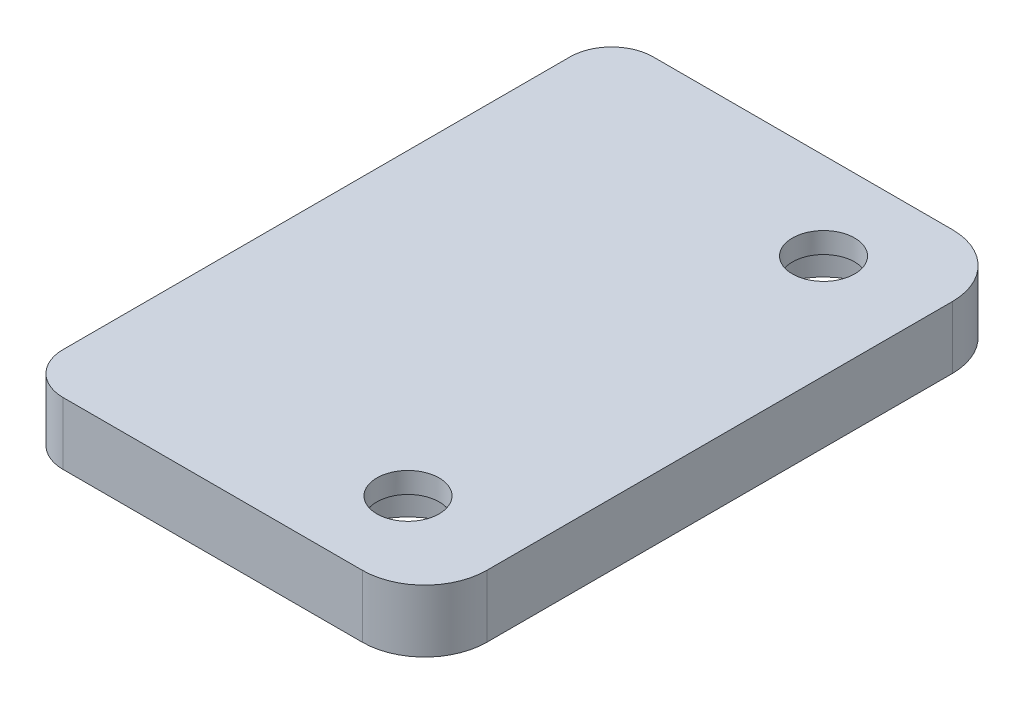
ISO-10303-21;
HEADER;
FILE_DESCRIPTION(('STEP AP214'),'2;1');
FILE_NAME('part.step','',(''),(''),'','','');
FILE_SCHEMA(('AUTOMOTIVE_DESIGN { 1 0 10303 214 1 1 1 1 }'));
ENDSEC;
DATA;
#1=APPLICATION_CONTEXT('core data for automotive mechanical design processes');
#2=APPLICATION_PROTOCOL_DEFINITION('international standard','automotive_design',2000,#1);
#3=PRODUCT_CONTEXT('',#1,'mechanical');
#4=PRODUCT('Part','Part','',(#3));
#5=PRODUCT_RELATED_PRODUCT_CATEGORY('part','',(#4));
#6=PRODUCT_DEFINITION_FORMATION('','',#4);
#7=PRODUCT_DEFINITION_CONTEXT('part definition',#1,'design');
#8=PRODUCT_DEFINITION('design','',#6,#7);
#9=PRODUCT_DEFINITION_SHAPE('','',#8);
#10=(LENGTH_UNIT() NAMED_UNIT(*) SI_UNIT(.MILLI.,.METRE.));
#11=(NAMED_UNIT(*) PLANE_ANGLE_UNIT() SI_UNIT($,.RADIAN.));
#12=(NAMED_UNIT(*) SI_UNIT($,.STERADIAN.) SOLID_ANGLE_UNIT());
#13=UNCERTAINTY_MEASURE_WITH_UNIT(LENGTH_MEASURE(1.E-05),#10,'distance_accuracy_value','');
#14=(GEOMETRIC_REPRESENTATION_CONTEXT(3) GLOBAL_UNCERTAINTY_ASSIGNED_CONTEXT((#13)) GLOBAL_UNIT_ASSIGNED_CONTEXT((#10,
#11,#12)) REPRESENTATION_CONTEXT('',''));
#15=CARTESIAN_POINT('',(0.,0.,0.));
#16=DIRECTION('',(0.,0.,1.));
#17=DIRECTION('',(1.,0.,0.));
#18=AXIS2_PLACEMENT_3D('',#15,#16,#17);
#19=CARTESIAN_POINT('',(4.7,0.,10.));
#20=DIRECTION('',(0.,1.,0.));
#21=DIRECTION('',(0.,0.,1.));
#22=AXIS2_PLACEMENT_3D('',#19,#20,#21);
#23=CYLINDRICAL_SURFACE('',#22,1.5);
#24=CARTESIAN_POINT('',(4.7,3.,10.));
#25=DIRECTION('',(0.,1.,0.));
#26=DIRECTION('',(0.,0.,1.));
#27=AXIS2_PLACEMENT_3D('',#24,#25,#26);
#28=CIRCLE('',#27,1.5);
#29=CARTESIAN_POINT('',(4.7,3.,11.5));
#30=VERTEX_POINT('',#29);
#31=EDGE_CURVE('E161',#30,#30,#28,.T.);
#32=ORIENTED_EDGE('',*,*,#31,.T.);
#33=EDGE_LOOP('',(#32));
#34=FACE_BOUND('',#33,.T.);
#35=CARTESIAN_POINT('',(4.7,2.,10.));
#36=DIRECTION('',(0.,-1.,0.));
#37=DIRECTION('',(0.,0.,-1.));
#38=AXIS2_PLACEMENT_3D('',#35,#36,#37);
#39=CIRCLE('',#38,1.5);
#40=CARTESIAN_POINT('',(4.7,2.,8.5));
#41=VERTEX_POINT('',#40);
#42=EDGE_CURVE('E38',#41,#41,#39,.F.);
#43=ORIENTED_EDGE('',*,*,#42,.F.);
#44=EDGE_LOOP('',(#43));
#45=FACE_BOUND('',#44,.T.);
#46=ADVANCED_FACE('F34',(#34,#45),#23,.F.);
#47=CARTESIAN_POINT('',(4.7,0.,-10.));
#48=DIRECTION('',(0.,1.,0.));
#49=DIRECTION('',(0.,0.,1.));
#50=AXIS2_PLACEMENT_3D('',#47,#48,#49);
#51=CYLINDRICAL_SURFACE('',#50,1.5);
#52=CARTESIAN_POINT('',(4.7,3.,-10.));
#53=DIRECTION('',(0.,1.,0.));
#54=DIRECTION('',(0.,0.,1.));
#55=AXIS2_PLACEMENT_3D('',#52,#53,#54);
#56=CIRCLE('',#55,1.5);
#57=CARTESIAN_POINT('',(4.7,3.,-8.5));
#58=VERTEX_POINT('',#57);
#59=EDGE_CURVE('E176',#58,#58,#56,.T.);
#60=ORIENTED_EDGE('',*,*,#59,.T.);
#61=EDGE_LOOP('',(#60));
#62=FACE_BOUND('',#61,.T.);
#63=CARTESIAN_POINT('',(4.7,2.,-10.));
#64=DIRECTION('',(0.,-1.,0.));
#65=DIRECTION('',(0.,0.,-1.));
#66=AXIS2_PLACEMENT_3D('',#63,#64,#65);
#67=CIRCLE('',#66,1.5);
#68=CARTESIAN_POINT('',(4.7,2.,-11.5));
#69=VERTEX_POINT('',#68);
#70=EDGE_CURVE('E155',#69,#69,#67,.F.);
#71=ORIENTED_EDGE('',*,*,#70,.F.);
#72=EDGE_LOOP('',(#71));
#73=FACE_BOUND('',#72,.T.);
#74=ADVANCED_FACE('F211',(#62,#73),#51,.F.);
#75=CARTESIAN_POINT('',(-9.7,3.,-14.2));
#76=DIRECTION('',(1.,0.,0.));
#77=DIRECTION('',(0.,0.,-1.));
#78=AXIS2_PLACEMENT_3D('',#75,#76,#77);
#79=PLANE('',#78);
#80=DIRECTION('',(0.,0.,1.));
#81=VECTOR('',#80,1.);
#82=CARTESIAN_POINT('',(-9.7,3.,-14.2));
#83=LINE('',#82,#81);
#84=CARTESIAN_POINT('',(-9.7,3.,-12.2));
#85=VERTEX_POINT('',#84);
#86=CARTESIAN_POINT('',(-9.7,3.,12.2));
#87=VERTEX_POINT('',#86);
#88=EDGE_CURVE('E124',#85,#87,#83,.T.);
#89=ORIENTED_EDGE('',*,*,#88,.F.);
#90=DIRECTION('',(0.,-1.,0.));
#91=VECTOR('',#90,1.);
#92=CARTESIAN_POINT('',(-9.7,3.,-12.2));
#93=LINE('',#92,#91);
#94=CARTESIAN_POINT('',(-9.7,0.,-12.2));
#95=VERTEX_POINT('',#94);
#96=EDGE_CURVE('E147',#85,#95,#93,.T.);
#97=ORIENTED_EDGE('',*,*,#96,.T.);
#98=DIRECTION('',(0.,0.,1.));
#99=VECTOR('',#98,1.);
#100=CARTESIAN_POINT('',(-9.7,0.,-14.2));
#101=LINE('',#100,#99);
#102=CARTESIAN_POINT('',(-9.7,0.,12.2));
#103=VERTEX_POINT('',#102);
#104=EDGE_CURVE('E179',#95,#103,#101,.T.);
#105=ORIENTED_EDGE('',*,*,#104,.T.);
#106=DIRECTION('',(0.,-1.,0.));
#107=VECTOR('',#106,1.);
#108=CARTESIAN_POINT('',(-9.7,3.,12.2));
#109=LINE('',#108,#107);
#110=EDGE_CURVE('E145',#103,#87,#109,.F.);
#111=ORIENTED_EDGE('',*,*,#110,.T.);
#112=EDGE_LOOP('',(#89,#97,#105,#111));
#113=FACE_BOUND('',#112,.T.);
#114=ADVANCED_FACE('F208',(#113),#79,.F.);
#115=CARTESIAN_POINT('',(9.7,3.,14.2));
#116=DIRECTION('',(0.,0.,-1.));
#117=DIRECTION('',(-1.,0.,0.));
#118=AXIS2_PLACEMENT_3D('',#115,#116,#117);
#119=PLANE('',#118);
#120=DIRECTION('',(1.,0.,0.));
#121=VECTOR('',#120,1.);
#122=CARTESIAN_POINT('',(9.7,3.,14.2));
#123=LINE('',#122,#121);
#124=CARTESIAN_POINT('',(-7.7,3.,14.2));
#125=VERTEX_POINT('',#124);
#126=CARTESIAN_POINT('',(6.7,3.,14.2));
#127=VERTEX_POINT('',#126);
#128=EDGE_CURVE('E127',#125,#127,#123,.T.);
#129=ORIENTED_EDGE('',*,*,#128,.F.);
#130=DIRECTION('',(0.,-1.,0.));
#131=VECTOR('',#130,1.);
#132=CARTESIAN_POINT('',(-7.7,3.,14.2));
#133=LINE('',#132,#131);
#134=CARTESIAN_POINT('',(-7.7,0.,14.2));
#135=VERTEX_POINT('',#134);
#136=EDGE_CURVE('E11',#125,#135,#133,.T.);
#137=ORIENTED_EDGE('',*,*,#136,.T.);
#138=DIRECTION('',(1.,0.,0.));
#139=VECTOR('',#138,1.);
#140=CARTESIAN_POINT('',(9.7,0.,14.2));
#141=LINE('',#140,#139);
#142=CARTESIAN_POINT('',(6.7,0.,14.2));
#143=VERTEX_POINT('',#142);
#144=EDGE_CURVE('E129',#135,#143,#141,.T.);
#145=ORIENTED_EDGE('',*,*,#144,.T.);
#146=DIRECTION('',(0.,-1.,0.));
#147=VECTOR('',#146,1.);
#148=CARTESIAN_POINT('',(6.7,3.,14.2));
#149=LINE('',#148,#147);
#150=EDGE_CURVE('E142',#143,#127,#149,.F.);
#151=ORIENTED_EDGE('',*,*,#150,.T.);
#152=EDGE_LOOP('',(#129,#137,#145,#151));
#153=FACE_BOUND('',#152,.T.);
#154=ADVANCED_FACE('F190',(#153),#119,.F.);
#155=CARTESIAN_POINT('',(9.7,3.,-14.2));
#156=DIRECTION('',(-1.,0.,0.));
#157=DIRECTION('',(0.,0.,1.));
#158=AXIS2_PLACEMENT_3D('',#155,#156,#157);
#159=PLANE('',#158);
#160=DIRECTION('',(0.,0.,-1.));
#161=VECTOR('',#160,1.);
#162=CARTESIAN_POINT('',(9.7,0.,-14.2));
#163=LINE('',#162,#161);
#164=CARTESIAN_POINT('',(9.7,0.,11.2));
#165=VERTEX_POINT('',#164);
#166=CARTESIAN_POINT('',(9.7,0.,-11.2));
#167=VERTEX_POINT('',#166);
#168=EDGE_CURVE('E125',#165,#167,#163,.T.);
#169=ORIENTED_EDGE('',*,*,#168,.T.);
#170=DIRECTION('',(0.,-1.,0.));
#171=VECTOR('',#170,1.);
#172=CARTESIAN_POINT('',(9.7,3.,-11.2));
#173=LINE('',#172,#171);
#174=CARTESIAN_POINT('',(9.7,3.,-11.2));
#175=VERTEX_POINT('',#174);
#176=EDGE_CURVE('E109',#167,#175,#173,.F.);
#177=ORIENTED_EDGE('',*,*,#176,.T.);
#178=DIRECTION('',(0.,0.,-1.));
#179=VECTOR('',#178,1.);
#180=CARTESIAN_POINT('',(9.7,3.,-14.2));
#181=LINE('',#180,#179);
#182=CARTESIAN_POINT('',(9.7,3.,11.2));
#183=VERTEX_POINT('',#182);
#184=EDGE_CURVE('E183',#183,#175,#181,.T.);
#185=ORIENTED_EDGE('',*,*,#184,.F.);
#186=DIRECTION('',(0.,-1.,0.));
#187=VECTOR('',#186,1.);
#188=CARTESIAN_POINT('',(9.7,3.,11.2));
#189=LINE('',#188,#187);
#190=EDGE_CURVE('E114',#183,#165,#189,.T.);
#191=ORIENTED_EDGE('',*,*,#190,.T.);
#192=EDGE_LOOP('',(#169,#177,#185,#191));
#193=FACE_BOUND('',#192,.T.);
#194=ADVANCED_FACE('F200',(#193),#159,.F.);
#195=CARTESIAN_POINT('',(9.7,3.,-14.2));
#196=DIRECTION('',(0.,0.,1.));
#197=DIRECTION('',(1.,0.,0.));
#198=AXIS2_PLACEMENT_3D('',#195,#196,#197);
#199=PLANE('',#198);
#200=DIRECTION('',(-1.,0.,0.));
#201=VECTOR('',#200,1.);
#202=CARTESIAN_POINT('',(9.7,0.,-14.2));
#203=LINE('',#202,#201);
#204=CARTESIAN_POINT('',(6.7,0.,-14.2));
#205=VERTEX_POINT('',#204);
#206=CARTESIAN_POINT('',(-7.7,0.,-14.2));
#207=VERTEX_POINT('',#206);
#208=EDGE_CURVE('E118',#205,#207,#203,.T.);
#209=ORIENTED_EDGE('',*,*,#208,.T.);
#210=DIRECTION('',(0.,-1.,0.));
#211=VECTOR('',#210,1.);
#212=CARTESIAN_POINT('',(-7.7,3.,-14.2));
#213=LINE('',#212,#211);
#214=CARTESIAN_POINT('',(-7.7,3.,-14.2));
#215=VERTEX_POINT('',#214);
#216=EDGE_CURVE('E59',#207,#215,#213,.F.);
#217=ORIENTED_EDGE('',*,*,#216,.T.);
#218=DIRECTION('',(-1.,0.,0.));
#219=VECTOR('',#218,1.);
#220=CARTESIAN_POINT('',(9.7,3.,-14.2));
#221=LINE('',#220,#219);
#222=CARTESIAN_POINT('',(6.7,3.,-14.2));
#223=VERTEX_POINT('',#222);
#224=EDGE_CURVE('E119',#223,#215,#221,.T.);
#225=ORIENTED_EDGE('',*,*,#224,.F.);
#226=DIRECTION('',(0.,-1.,0.));
#227=VECTOR('',#226,1.);
#228=CARTESIAN_POINT('',(6.7,3.,-14.2));
#229=LINE('',#228,#227);
#230=EDGE_CURVE('E108',#223,#205,#229,.T.);
#231=ORIENTED_EDGE('',*,*,#230,.T.);
#232=EDGE_LOOP('',(#209,#217,#225,#231));
#233=FACE_BOUND('',#232,.T.);
#234=ADVANCED_FACE('F117',(#233),#199,.F.);
#235=CARTESIAN_POINT('',(0.,3.,0.));
#236=DIRECTION('',(0.,-1.,0.));
#237=DIRECTION('',(0.,0.,-1.));
#238=AXIS2_PLACEMENT_3D('',#235,#236,#237);
#239=PLANE('',#238);
#240=ORIENTED_EDGE('',*,*,#59,.F.);
#241=EDGE_LOOP('',(#240));
#242=FACE_BOUND('',#241,.T.);
#243=ORIENTED_EDGE('',*,*,#31,.F.);
#244=EDGE_LOOP('',(#243));
#245=FACE_BOUND('',#244,.T.);
#246=ORIENTED_EDGE('',*,*,#224,.T.);
#247=CARTESIAN_POINT('',(-7.7,3.,-12.2));
#248=DIRECTION('',(0.,-1.,0.));
#249=DIRECTION('',(0.,0.,-1.));
#250=AXIS2_PLACEMENT_3D('',#247,#248,#249);
#251=CIRCLE('',#250,2.);
#252=EDGE_CURVE('E43',#215,#85,#251,.F.);
#253=ORIENTED_EDGE('',*,*,#252,.T.);
#254=ORIENTED_EDGE('',*,*,#88,.T.);
#255=CARTESIAN_POINT('',(-7.7,3.,12.2));
#256=DIRECTION('',(0.,-1.,0.));
#257=DIRECTION('',(0.,0.,-1.));
#258=AXIS2_PLACEMENT_3D('',#255,#256,#257);
#259=CIRCLE('',#258,2.);
#260=EDGE_CURVE('E51',#87,#125,#259,.F.);
#261=ORIENTED_EDGE('',*,*,#260,.T.);
#262=ORIENTED_EDGE('',*,*,#128,.T.);
#263=CARTESIAN_POINT('',(6.7,3.,11.2));
#264=DIRECTION('',(0.,-1.,0.));
#265=DIRECTION('',(0.,0.,-1.));
#266=AXIS2_PLACEMENT_3D('',#263,#264,#265);
#267=CIRCLE('',#266,3.);
#268=EDGE_CURVE('E138',#127,#183,#267,.F.);
#269=ORIENTED_EDGE('',*,*,#268,.T.);
#270=ORIENTED_EDGE('',*,*,#184,.T.);
#271=CARTESIAN_POINT('',(6.7,3.,-11.2));
#272=DIRECTION('',(0.,-1.,0.));
#273=DIRECTION('',(0.,0.,-1.));
#274=AXIS2_PLACEMENT_3D('',#271,#272,#273);
#275=CIRCLE('',#274,3.);
#276=EDGE_CURVE('E140',#175,#223,#275,.F.);
#277=ORIENTED_EDGE('',*,*,#276,.T.);
#278=EDGE_LOOP('',(#246,#253,#254,#261,#262,#269,#270,#277));
#279=FACE_BOUND('',#278,.T.);
#280=ADVANCED_FACE('F198',(#242,#245,#279),#239,.F.);
#281=CARTESIAN_POINT('',(0.,0.,0.));
#282=DIRECTION('',(0.,-1.,0.));
#283=DIRECTION('',(0.,0.,-1.));
#284=AXIS2_PLACEMENT_3D('',#281,#282,#283);
#285=PLANE('',#284);
#286=CARTESIAN_POINT('',(4.7,0.,10.));
#287=DIRECTION('',(0.,-1.,0.));
#288=DIRECTION('',(0.,0.,-1.));
#289=AXIS2_PLACEMENT_3D('',#286,#287,#288);
#290=CIRCLE('',#289,3.);
#291=CARTESIAN_POINT('',(4.7,0.,7.));
#292=VERTEX_POINT('',#291);
#293=EDGE_CURVE('E163',#292,#292,#290,.T.);
#294=ORIENTED_EDGE('',*,*,#293,.F.);
#295=EDGE_LOOP('',(#294));
#296=FACE_BOUND('',#295,.T.);
#297=CARTESIAN_POINT('',(4.7,0.,-10.));
#298=DIRECTION('',(0.,-1.,0.));
#299=DIRECTION('',(0.,0.,-1.));
#300=AXIS2_PLACEMENT_3D('',#297,#298,#299);
#301=CIRCLE('',#300,3.);
#302=CARTESIAN_POINT('',(4.7,0.,-13.));
#303=VERTEX_POINT('',#302);
#304=EDGE_CURVE('E173',#303,#303,#301,.T.);
#305=ORIENTED_EDGE('',*,*,#304,.F.);
#306=EDGE_LOOP('',(#305));
#307=FACE_BOUND('',#306,.T.);
#308=ORIENTED_EDGE('',*,*,#104,.F.);
#309=CARTESIAN_POINT('',(-7.7,0.,-12.2));
#310=DIRECTION('',(0.,-1.,0.));
#311=DIRECTION('',(0.,0.,-1.));
#312=AXIS2_PLACEMENT_3D('',#309,#310,#311);
#313=CIRCLE('',#312,2.);
#314=EDGE_CURVE('E123',#95,#207,#313,.T.);
#315=ORIENTED_EDGE('',*,*,#314,.T.);
#316=ORIENTED_EDGE('',*,*,#208,.F.);
#317=CARTESIAN_POINT('',(6.7,0.,-11.2));
#318=DIRECTION('',(0.,-1.,0.));
#319=DIRECTION('',(0.,0.,-1.));
#320=AXIS2_PLACEMENT_3D('',#317,#318,#319);
#321=CIRCLE('',#320,3.);
#322=EDGE_CURVE('E104',#205,#167,#321,.T.);
#323=ORIENTED_EDGE('',*,*,#322,.T.);
#324=ORIENTED_EDGE('',*,*,#168,.F.);
#325=CARTESIAN_POINT('',(6.7,0.,11.2));
#326=DIRECTION('',(0.,-1.,0.));
#327=DIRECTION('',(0.,0.,-1.));
#328=AXIS2_PLACEMENT_3D('',#325,#326,#327);
#329=CIRCLE('',#328,3.);
#330=EDGE_CURVE('E115',#165,#143,#329,.T.);
#331=ORIENTED_EDGE('',*,*,#330,.T.);
#332=ORIENTED_EDGE('',*,*,#144,.F.);
#333=CARTESIAN_POINT('',(-7.7,0.,12.2));
#334=DIRECTION('',(0.,-1.,0.));
#335=DIRECTION('',(0.,0.,-1.));
#336=AXIS2_PLACEMENT_3D('',#333,#334,#335);
#337=CIRCLE('',#336,2.);
#338=EDGE_CURVE('E150',#135,#103,#337,.T.);
#339=ORIENTED_EDGE('',*,*,#338,.T.);
#340=EDGE_LOOP('',(#308,#315,#316,#323,#324,#331,#332,#339));
#341=FACE_BOUND('',#340,.T.);
#342=ADVANCED_FACE('F122',(#296,#307,#341),#285,.T.);
#343=CARTESIAN_POINT('',(6.7,3.,-11.2));
#344=DIRECTION('',(0.,-1.,0.));
#345=DIRECTION('',(0.,0.,-1.));
#346=AXIS2_PLACEMENT_3D('',#343,#344,#345);
#347=CYLINDRICAL_SURFACE('',#346,3.);
#348=ORIENTED_EDGE('',*,*,#276,.F.);
#349=ORIENTED_EDGE('',*,*,#176,.F.);
#350=ORIENTED_EDGE('',*,*,#322,.F.);
#351=ORIENTED_EDGE('',*,*,#230,.F.);
#352=EDGE_LOOP('',(#348,#349,#350,#351));
#353=FACE_BOUND('',#352,.T.);
#354=ADVANCED_FACE('F107',(#353),#347,.T.);
#355=CARTESIAN_POINT('',(6.7,3.,11.2));
#356=DIRECTION('',(0.,-1.,0.));
#357=DIRECTION('',(0.,0.,-1.));
#358=AXIS2_PLACEMENT_3D('',#355,#356,#357);
#359=CYLINDRICAL_SURFACE('',#358,3.);
#360=ORIENTED_EDGE('',*,*,#268,.F.);
#361=ORIENTED_EDGE('',*,*,#150,.F.);
#362=ORIENTED_EDGE('',*,*,#330,.F.);
#363=ORIENTED_EDGE('',*,*,#190,.F.);
#364=EDGE_LOOP('',(#360,#361,#362,#363));
#365=FACE_BOUND('',#364,.T.);
#366=ADVANCED_FACE('F196',(#365),#359,.T.);
#367=CARTESIAN_POINT('',(-7.7,3.,-12.2));
#368=DIRECTION('',(0.,-1.,0.));
#369=DIRECTION('',(0.,0.,-1.));
#370=AXIS2_PLACEMENT_3D('',#367,#368,#369);
#371=CYLINDRICAL_SURFACE('',#370,2.);
#372=ORIENTED_EDGE('',*,*,#252,.F.);
#373=ORIENTED_EDGE('',*,*,#216,.F.);
#374=ORIENTED_EDGE('',*,*,#314,.F.);
#375=ORIENTED_EDGE('',*,*,#96,.F.);
#376=EDGE_LOOP('',(#372,#373,#374,#375));
#377=FACE_BOUND('',#376,.T.);
#378=ADVANCED_FACE('F301',(#377),#371,.T.);
#379=CARTESIAN_POINT('',(-7.7,3.,12.2));
#380=DIRECTION('',(0.,-1.,0.));
#381=DIRECTION('',(0.,0.,-1.));
#382=AXIS2_PLACEMENT_3D('',#379,#380,#381);
#383=CYLINDRICAL_SURFACE('',#382,2.);
#384=ORIENTED_EDGE('',*,*,#260,.F.);
#385=ORIENTED_EDGE('',*,*,#110,.F.);
#386=ORIENTED_EDGE('',*,*,#338,.F.);
#387=ORIENTED_EDGE('',*,*,#136,.F.);
#388=EDGE_LOOP('',(#384,#385,#386,#387));
#389=FACE_BOUND('',#388,.T.);
#390=ADVANCED_FACE('F36',(#389),#383,.T.);
#391=CARTESIAN_POINT('',(4.7,2.,-10.));
#392=DIRECTION('',(0.,-1.,0.));
#393=DIRECTION('',(0.,0.,-1.));
#394=AXIS2_PLACEMENT_3D('',#391,#392,#393);
#395=PLANE('',#394);
#396=CARTESIAN_POINT('',(4.7,2.,-10.));
#397=DIRECTION('',(0.,-1.,0.));
#398=DIRECTION('',(0.,0.,-1.));
#399=AXIS2_PLACEMENT_3D('',#396,#397,#398);
#400=CIRCLE('',#399,3.);
#401=CARTESIAN_POINT('',(4.7,2.,-13.));
#402=VERTEX_POINT('',#401);
#403=EDGE_CURVE('E168',#402,#402,#400,.T.);
#404=ORIENTED_EDGE('',*,*,#403,.T.);
#405=EDGE_LOOP('',(#404));
#406=FACE_BOUND('',#405,.T.);
#407=ORIENTED_EDGE('',*,*,#70,.T.);
#408=EDGE_LOOP('',(#407));
#409=FACE_BOUND('',#408,.T.);
#410=ADVANCED_FACE('F238',(#406,#409),#395,.T.);
#411=CARTESIAN_POINT('',(4.7,2.,-10.));
#412=DIRECTION('',(0.,-1.,0.));
#413=DIRECTION('',(0.,0.,-1.));
#414=AXIS2_PLACEMENT_3D('',#411,#412,#413);
#415=CYLINDRICAL_SURFACE('',#414,3.);
#416=ORIENTED_EDGE('',*,*,#403,.F.);
#417=EDGE_LOOP('',(#416));
#418=FACE_BOUND('',#417,.T.);
#419=ORIENTED_EDGE('',*,*,#304,.T.);
#420=EDGE_LOOP('',(#419));
#421=FACE_BOUND('',#420,.T.);
#422=ADVANCED_FACE('F235',(#418,#421),#415,.F.);
#423=CARTESIAN_POINT('',(4.7,2.,10.));
#424=DIRECTION('',(0.,-1.,0.));
#425=DIRECTION('',(0.,0.,-1.));
#426=AXIS2_PLACEMENT_3D('',#423,#424,#425);
#427=PLANE('',#426);
#428=CARTESIAN_POINT('',(4.7,2.,10.));
#429=DIRECTION('',(0.,-1.,0.));
#430=DIRECTION('',(0.,0.,-1.));
#431=AXIS2_PLACEMENT_3D('',#428,#429,#430);
#432=CIRCLE('',#431,3.);
#433=CARTESIAN_POINT('',(4.7,2.,7.));
#434=VERTEX_POINT('',#433);
#435=EDGE_CURVE('E157',#434,#434,#432,.T.);
#436=ORIENTED_EDGE('',*,*,#435,.T.);
#437=EDGE_LOOP('',(#436));
#438=FACE_BOUND('',#437,.T.);
#439=ORIENTED_EDGE('',*,*,#42,.T.);
#440=EDGE_LOOP('',(#439));
#441=FACE_BOUND('',#440,.T.);
#442=ADVANCED_FACE('F237',(#438,#441),#427,.T.);
#443=CARTESIAN_POINT('',(4.7,2.,10.));
#444=DIRECTION('',(0.,-1.,0.));
#445=DIRECTION('',(0.,0.,-1.));
#446=AXIS2_PLACEMENT_3D('',#443,#444,#445);
#447=CYLINDRICAL_SURFACE('',#446,3.);
#448=ORIENTED_EDGE('',*,*,#435,.F.);
#449=EDGE_LOOP('',(#448));
#450=FACE_BOUND('',#449,.T.);
#451=ORIENTED_EDGE('',*,*,#293,.T.);
#452=EDGE_LOOP('',(#451));
#453=FACE_BOUND('',#452,.T.);
#454=ADVANCED_FACE('F244',(#450,#453),#447,.F.);
#455=CLOSED_SHELL('',(#46,#74,#114,#154,#194,#234,#280,#342,#354,#366,#378,#390,#410,#422,#442,#454));
#456=MANIFOLD_SOLID_BREP('B2',#455);
#457=ADVANCED_BREP_SHAPE_REPRESENTATION('',(#18,#456),#14);
#458=SHAPE_DEFINITION_REPRESENTATION(#9,#457);
ENDSEC;
END-ISO-10303-21;
